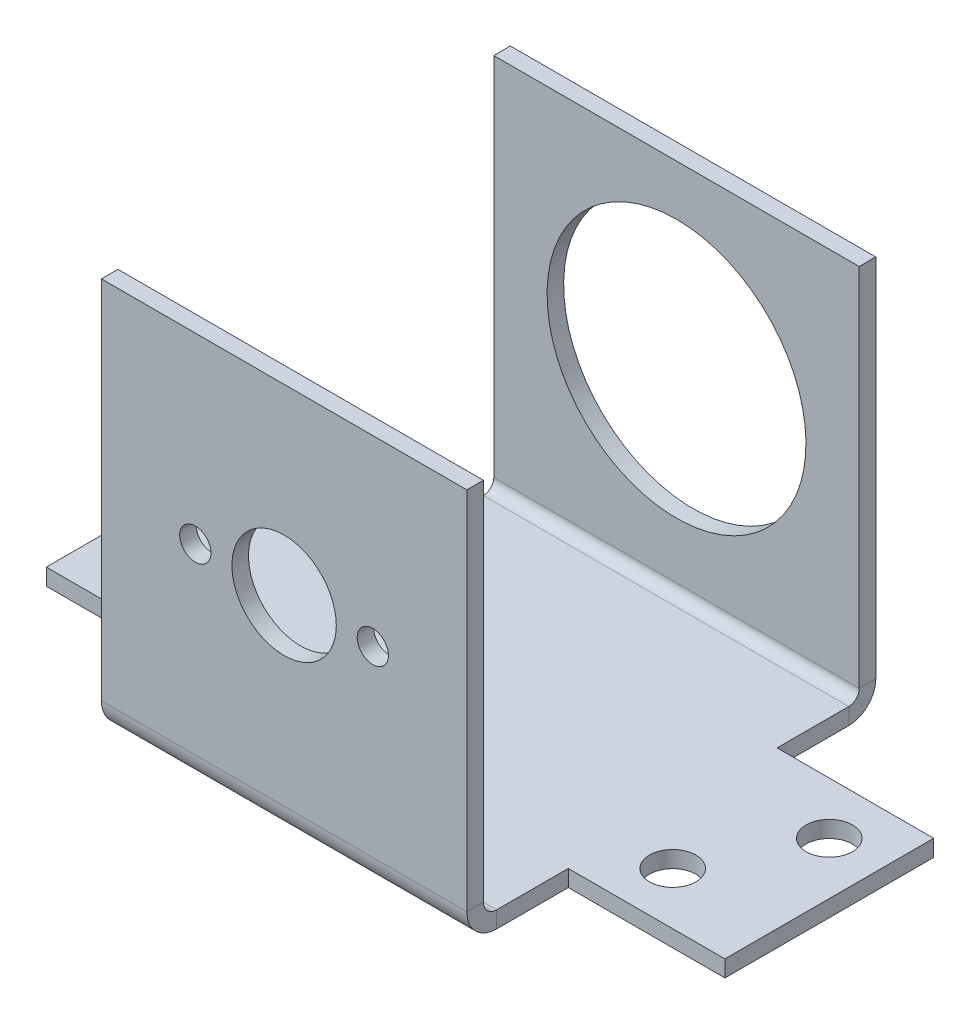
ISO-10303-21;
HEADER;
FILE_DESCRIPTION(('STEP AP214'),'2;1');
FILE_NAME('part.step','',(''),(''),'','','');
FILE_SCHEMA(('AUTOMOTIVE_DESIGN { 1 0 10303 214 1 1 1 1 }'));
ENDSEC;
DATA;
#1=APPLICATION_CONTEXT('core data for automotive mechanical design processes');
#2=APPLICATION_PROTOCOL_DEFINITION('international standard','automotive_design',2000,#1);
#3=PRODUCT_CONTEXT('',#1,'mechanical');
#4=PRODUCT('Part','Part','',(#3));
#5=PRODUCT_RELATED_PRODUCT_CATEGORY('part','',(#4));
#6=PRODUCT_DEFINITION_FORMATION('','',#4);
#7=PRODUCT_DEFINITION_CONTEXT('part definition',#1,'design');
#8=PRODUCT_DEFINITION('design','',#6,#7);
#9=PRODUCT_DEFINITION_SHAPE('','',#8);
#10=(LENGTH_UNIT() NAMED_UNIT(*) SI_UNIT(.MILLI.,.METRE.));
#11=(NAMED_UNIT(*) PLANE_ANGLE_UNIT() SI_UNIT($,.RADIAN.));
#12=(NAMED_UNIT(*) SI_UNIT($,.STERADIAN.) SOLID_ANGLE_UNIT());
#13=UNCERTAINTY_MEASURE_WITH_UNIT(LENGTH_MEASURE(1.E-05),#10,'distance_accuracy_value','');
#14=(GEOMETRIC_REPRESENTATION_CONTEXT(3) GLOBAL_UNCERTAINTY_ASSIGNED_CONTEXT((#13)) GLOBAL_UNIT_ASSIGNED_CONTEXT((#10,
#11,#12)) REPRESENTATION_CONTEXT('',''));
#15=CARTESIAN_POINT('',(0.,0.,0.));
#16=DIRECTION('',(0.,0.,1.));
#17=DIRECTION('',(1.,0.,0.));
#18=AXIS2_PLACEMENT_3D('',#15,#16,#17);
#19=CARTESIAN_POINT('',(-17.5,-20.3575000000001,-35.79375));
#20=DIRECTION('',(1.,0.,0.));
#21=DIRECTION('',(0.,0.,-1.));
#22=AXIS2_PLACEMENT_3D('',#19,#20,#21);
#23=PLANE('',#22);
#24=DIRECTION('',(0.,0.,1.));
#25=VECTOR('',#24,1.);
#26=CARTESIAN_POINT('',(-17.5,-18.7700000000001,-35.79375));
#27=LINE('',#26,#25);
#28=CARTESIAN_POINT('',(-17.5,-18.77,-2.06375));
#29=VERTEX_POINT('',#28);
#30=CARTESIAN_POINT('',(-17.5,-18.77,-8.92874999999999));
#31=VERTEX_POINT('',#30);
#32=EDGE_CURVE('E406',#29,#31,#27,.F.);
#33=ORIENTED_EDGE('',*,*,#32,.T.);
#34=DIRECTION('',(0.,1.,0.));
#35=VECTOR('',#34,1.);
#36=CARTESIAN_POINT('',(-17.5,-20.3575,-8.92874999999999));
#37=LINE('',#36,#35);
#38=CARTESIAN_POINT('',(-17.5,-20.3575,-8.92874999999999));
#39=VERTEX_POINT('',#38);
#40=EDGE_CURVE('E112',#39,#31,#37,.T.);
#41=ORIENTED_EDGE('',*,*,#40,.F.);
#42=DIRECTION('',(0.,0.,-1.));
#43=VECTOR('',#42,1.);
#44=CARTESIAN_POINT('',(-17.5,-20.3575,0.));
#45=LINE('',#44,#43);
#46=CARTESIAN_POINT('',(-17.5,-20.3575,-2.06374999999999));
#47=VERTEX_POINT('',#46);
#48=EDGE_CURVE('E396',#47,#39,#45,.T.);
#49=ORIENTED_EDGE('',*,*,#48,.F.);
#50=DIRECTION('',(0.,1.,0.));
#51=VECTOR('',#50,1.);
#52=CARTESIAN_POINT('',(-17.5,-18.77,-2.06375));
#53=LINE('',#52,#51);
#54=EDGE_CURVE('E414',#29,#47,#53,.F.);
#55=ORIENTED_EDGE('',*,*,#54,.F.);
#56=EDGE_LOOP('',(#33,#41,#49,#55));
#57=FACE_BOUND('',#56,.T.);
#58=ADVANCED_FACE('F86',(#57),#23,.F.);
#59=CARTESIAN_POINT('',(17.5,-20.3575,-0.793749999999994));
#60=DIRECTION('',(-1.,0.,0.));
#61=DIRECTION('',(0.,0.,1.));
#62=AXIS2_PLACEMENT_3D('',#59,#60,#61);
#63=PLANE('',#62);
#64=DIRECTION('',(0.,0.,-1.));
#65=VECTOR('',#64,1.);
#66=CARTESIAN_POINT('',(17.5,-18.77,-0.79375));
#67=LINE('',#66,#65);
#68=CARTESIAN_POINT('',(17.5,-18.7700000000001,-35.79375));
#69=VERTEX_POINT('',#68);
#70=CARTESIAN_POINT('',(17.5,-18.7700000000001,-28.92875));
#71=VERTEX_POINT('',#70);
#72=EDGE_CURVE('E399',#69,#71,#67,.F.);
#73=ORIENTED_EDGE('',*,*,#72,.T.);
#74=DIRECTION('',(0.,1.,0.));
#75=VECTOR('',#74,1.);
#76=CARTESIAN_POINT('',(17.5,-20.3575000000001,-28.92875));
#77=LINE('',#76,#75);
#78=CARTESIAN_POINT('',(17.5,-20.3575000000001,-28.92875));
#79=VERTEX_POINT('',#78);
#80=EDGE_CURVE('E301',#79,#71,#77,.T.);
#81=ORIENTED_EDGE('',*,*,#80,.F.);
#82=DIRECTION('',(0.,0.,1.));
#83=VECTOR('',#82,1.);
#84=CARTESIAN_POINT('',(17.5,-20.3575,0.));
#85=LINE('',#84,#83);
#86=CARTESIAN_POINT('',(17.5,-20.3575000000001,-35.79375));
#87=VERTEX_POINT('',#86);
#88=EDGE_CURVE('E387',#87,#79,#85,.T.);
#89=ORIENTED_EDGE('',*,*,#88,.F.);
#90=DIRECTION('',(0.,1.,0.));
#91=VECTOR('',#90,1.);
#92=CARTESIAN_POINT('',(17.5,-20.3575000000001,-35.79375));
#93=LINE('',#92,#91);
#94=EDGE_CURVE('E383',#87,#69,#93,.T.);
#95=ORIENTED_EDGE('',*,*,#94,.T.);
#96=EDGE_LOOP('',(#73,#81,#89,#95));
#97=FACE_BOUND('',#96,.T.);
#98=ADVANCED_FACE('F531',(#97),#63,.F.);
#99=CARTESIAN_POINT('',(17.5,17.5,0.79375));
#100=DIRECTION('',(1.,0.,0.));
#101=DIRECTION('',(0.,1.,0.));
#102=AXIS2_PLACEMENT_3D('',#99,#100,#101);
#103=PLANE('',#102);
#104=DIRECTION('',(0.,0.,1.));
#105=VECTOR('',#104,1.);
#106=CARTESIAN_POINT('',(17.5,-17.5,0.79375));
#107=LINE('',#106,#105);
#108=CARTESIAN_POINT('',(17.5,-17.5,-0.79375));
#109=VERTEX_POINT('',#108);
#110=CARTESIAN_POINT('',(17.5,-17.5,0.79375));
#111=VERTEX_POINT('',#110);
#112=EDGE_CURVE('E13',#109,#111,#107,.T.);
#113=ORIENTED_EDGE('',*,*,#112,.F.);
#114=DIRECTION('',(0.,1.,0.));
#115=VECTOR('',#114,1.);
#116=CARTESIAN_POINT('',(17.5,0.,-0.79375));
#117=LINE('',#116,#115);
#118=CARTESIAN_POINT('',(17.5,17.5,-0.79375));
#119=VERTEX_POINT('',#118);
#120=EDGE_CURVE('E483',#109,#119,#117,.T.);
#121=ORIENTED_EDGE('',*,*,#120,.T.);
#122=DIRECTION('',(0.,0.,1.));
#123=VECTOR('',#122,1.);
#124=CARTESIAN_POINT('',(17.5,17.5,0.79375));
#125=LINE('',#124,#123);
#126=CARTESIAN_POINT('',(17.5,17.5,0.79375));
#127=VERTEX_POINT('',#126);
#128=EDGE_CURVE('E96',#119,#127,#125,.T.);
#129=ORIENTED_EDGE('',*,*,#128,.T.);
#130=DIRECTION('',(0.,1.,0.));
#131=VECTOR('',#130,1.);
#132=CARTESIAN_POINT('',(17.5,17.5,0.79375));
#133=LINE('',#132,#131);
#134=EDGE_CURVE('E453',#111,#127,#133,.T.);
#135=ORIENTED_EDGE('',*,*,#134,.F.);
#136=EDGE_LOOP('',(#113,#121,#129,#135));
#137=FACE_BOUND('',#136,.T.);
#138=ADVANCED_FACE('F529',(#137),#103,.T.);
#139=CARTESIAN_POINT('',(-17.5,17.5,0.79375));
#140=DIRECTION('',(0.,1.,0.));
#141=DIRECTION('',(-1.,0.,0.));
#142=AXIS2_PLACEMENT_3D('',#139,#140,#141);
#143=PLANE('',#142);
#144=ORIENTED_EDGE('',*,*,#128,.F.);
#145=DIRECTION('',(1.,0.,0.));
#146=VECTOR('',#145,1.);
#147=CARTESIAN_POINT('',(0.,17.5,-0.79375));
#148=LINE('',#147,#146);
#149=CARTESIAN_POINT('',(-17.5,17.5,-0.79375));
#150=VERTEX_POINT('',#149);
#151=EDGE_CURVE('E478',#119,#150,#148,.F.);
#152=ORIENTED_EDGE('',*,*,#151,.T.);
#153=DIRECTION('',(0.,0.,1.));
#154=VECTOR('',#153,1.);
#155=CARTESIAN_POINT('',(-17.5,17.5,0.79375));
#156=LINE('',#155,#154);
#157=CARTESIAN_POINT('',(-17.5,17.5,0.79375));
#158=VERTEX_POINT('',#157);
#159=EDGE_CURVE('E495',#150,#158,#156,.T.);
#160=ORIENTED_EDGE('',*,*,#159,.T.);
#161=DIRECTION('',(-1.,0.,0.));
#162=VECTOR('',#161,1.);
#163=CARTESIAN_POINT('',(-17.5,17.5,0.79375));
#164=LINE('',#163,#162);
#165=EDGE_CURVE('E457',#127,#158,#164,.T.);
#166=ORIENTED_EDGE('',*,*,#165,.F.);
#167=EDGE_LOOP('',(#144,#152,#160,#166));
#168=FACE_BOUND('',#167,.T.);
#169=ADVANCED_FACE('F513',(#168),#143,.T.);
#170=CARTESIAN_POINT('',(-17.5,17.5,0.79375));
#171=DIRECTION('',(-1.,0.,0.));
#172=DIRECTION('',(0.,-1.,0.));
#173=AXIS2_PLACEMENT_3D('',#170,#171,#172);
#174=PLANE('',#173);
#175=ORIENTED_EDGE('',*,*,#159,.F.);
#176=DIRECTION('',(0.,1.,0.));
#177=VECTOR('',#176,1.);
#178=CARTESIAN_POINT('',(-17.5,0.,-0.79375));
#179=LINE('',#178,#177);
#180=CARTESIAN_POINT('',(-17.5,-17.5,-0.79375));
#181=VERTEX_POINT('',#180);
#182=EDGE_CURVE('E473',#150,#181,#179,.F.);
#183=ORIENTED_EDGE('',*,*,#182,.T.);
#184=DIRECTION('',(0.,0.,1.));
#185=VECTOR('',#184,1.);
#186=CARTESIAN_POINT('',(-17.5,-17.5,0.79375));
#187=LINE('',#186,#185);
#188=CARTESIAN_POINT('',(-17.5,-17.5,0.79375));
#189=VERTEX_POINT('',#188);
#190=EDGE_CURVE('E469',#181,#189,#187,.T.);
#191=ORIENTED_EDGE('',*,*,#190,.T.);
#192=DIRECTION('',(0.,-1.,0.));
#193=VECTOR('',#192,1.);
#194=CARTESIAN_POINT('',(-17.5,17.5,0.79375));
#195=LINE('',#194,#193);
#196=EDGE_CURVE('E444',#158,#189,#195,.T.);
#197=ORIENTED_EDGE('',*,*,#196,.F.);
#198=EDGE_LOOP('',(#175,#183,#191,#197));
#199=FACE_BOUND('',#198,.T.);
#200=ADVANCED_FACE('F503',(#199),#174,.T.);
#201=CARTESIAN_POINT('',(8.5,0.,0.79375));
#202=DIRECTION('',(0.,0.,1.));
#203=DIRECTION('',(1.,0.,0.));
#204=AXIS2_PLACEMENT_3D('',#201,#202,#203);
#205=CYLINDRICAL_SURFACE('',#204,1.5);
#206=CARTESIAN_POINT('',(8.5,0.,0.79375));
#207=DIRECTION('',(0.,0.,1.));
#208=DIRECTION('',(1.,0.,0.));
#209=AXIS2_PLACEMENT_3D('',#206,#207,#208);
#210=CIRCLE('',#209,1.5);
#211=CARTESIAN_POINT('',(10.,0.,0.79375));
#212=VERTEX_POINT('',#211);
#213=EDGE_CURVE('E440',#212,#212,#210,.T.);
#214=ORIENTED_EDGE('',*,*,#213,.T.);
#215=EDGE_LOOP('',(#214));
#216=FACE_BOUND('',#215,.T.);
#217=CARTESIAN_POINT('',(8.5,0.,-0.79375));
#218=DIRECTION('',(0.,0.,1.));
#219=DIRECTION('',(1.,0.,0.));
#220=AXIS2_PLACEMENT_3D('',#217,#218,#219);
#221=CIRCLE('',#220,1.5);
#222=CARTESIAN_POINT('',(10.,0.,-0.79375));
#223=VERTEX_POINT('',#222);
#224=EDGE_CURVE('E428',#223,#223,#221,.T.);
#225=ORIENTED_EDGE('',*,*,#224,.F.);
#226=EDGE_LOOP('',(#225));
#227=FACE_BOUND('',#226,.T.);
#228=ADVANCED_FACE('F571',(#216,#227),#205,.F.);
#229=CARTESIAN_POINT('',(-8.5,0.,0.79375));
#230=DIRECTION('',(0.,0.,1.));
#231=DIRECTION('',(1.,0.,0.));
#232=AXIS2_PLACEMENT_3D('',#229,#230,#231);
#233=CYLINDRICAL_SURFACE('',#232,1.5);
#234=CARTESIAN_POINT('',(-8.5,0.,0.79375));
#235=DIRECTION('',(0.,0.,1.));
#236=DIRECTION('',(1.,0.,0.));
#237=AXIS2_PLACEMENT_3D('',#234,#235,#236);
#238=CIRCLE('',#237,1.5);
#239=CARTESIAN_POINT('',(-7.,0.,0.79375));
#240=VERTEX_POINT('',#239);
#241=EDGE_CURVE('E461',#240,#240,#238,.T.);
#242=ORIENTED_EDGE('',*,*,#241,.T.);
#243=EDGE_LOOP('',(#242));
#244=FACE_BOUND('',#243,.T.);
#245=CARTESIAN_POINT('',(-8.5,0.,-0.79375));
#246=DIRECTION('',(0.,0.,1.));
#247=DIRECTION('',(1.,0.,0.));
#248=AXIS2_PLACEMENT_3D('',#245,#246,#247);
#249=CIRCLE('',#248,1.5);
#250=CARTESIAN_POINT('',(-7.,0.,-0.79375));
#251=VERTEX_POINT('',#250);
#252=EDGE_CURVE('E482',#251,#251,#249,.T.);
#253=ORIENTED_EDGE('',*,*,#252,.F.);
#254=EDGE_LOOP('',(#253));
#255=FACE_BOUND('',#254,.T.);
#256=ADVANCED_FACE('F574',(#244,#255),#233,.F.);
#257=CARTESIAN_POINT('',(0.,0.,0.79375));
#258=DIRECTION('',(0.,0.,1.));
#259=DIRECTION('',(1.,0.,0.));
#260=AXIS2_PLACEMENT_3D('',#257,#258,#259);
#261=CYLINDRICAL_SURFACE('',#260,5.);
#262=CARTESIAN_POINT('',(0.,0.,0.79375));
#263=DIRECTION('',(0.,0.,1.));
#264=DIRECTION('',(1.,0.,0.));
#265=AXIS2_PLACEMENT_3D('',#262,#263,#264);
#266=CIRCLE('',#265,5.);
#267=CARTESIAN_POINT('',(5.,0.,0.79375));
#268=VERTEX_POINT('',#267);
#269=EDGE_CURVE('E465',#268,#268,#266,.T.);
#270=ORIENTED_EDGE('',*,*,#269,.T.);
#271=EDGE_LOOP('',(#270));
#272=FACE_BOUND('',#271,.T.);
#273=CARTESIAN_POINT('',(0.,0.,-0.79375));
#274=DIRECTION('',(0.,0.,1.));
#275=DIRECTION('',(1.,0.,0.));
#276=AXIS2_PLACEMENT_3D('',#273,#274,#275);
#277=CIRCLE('',#276,5.);
#278=CARTESIAN_POINT('',(5.,0.,-0.79375));
#279=VERTEX_POINT('',#278);
#280=EDGE_CURVE('E445',#279,#279,#277,.T.);
#281=ORIENTED_EDGE('',*,*,#280,.F.);
#282=EDGE_LOOP('',(#281));
#283=FACE_BOUND('',#282,.T.);
#284=ADVANCED_FACE('F88',(#272,#283),#261,.F.);
#285=CARTESIAN_POINT('',(0.,0.,0.79375));
#286=DIRECTION('',(0.,0.,1.));
#287=DIRECTION('',(1.,0.,0.));
#288=AXIS2_PLACEMENT_3D('',#285,#286,#287);
#289=PLANE('',#288);
#290=ORIENTED_EDGE('',*,*,#213,.F.);
#291=EDGE_LOOP('',(#290));
#292=FACE_BOUND('',#291,.T.);
#293=ORIENTED_EDGE('',*,*,#196,.T.);
#294=DIRECTION('',(1.,0.,0.));
#295=VECTOR('',#294,1.);
#296=CARTESIAN_POINT('',(-17.5,-17.5,0.79375));
#297=LINE('',#296,#295);
#298=EDGE_CURVE('E449',#189,#111,#297,.T.);
#299=ORIENTED_EDGE('',*,*,#298,.T.);
#300=ORIENTED_EDGE('',*,*,#134,.T.);
#301=ORIENTED_EDGE('',*,*,#165,.T.);
#302=EDGE_LOOP('',(#293,#299,#300,#301));
#303=FACE_BOUND('',#302,.T.);
#304=ORIENTED_EDGE('',*,*,#241,.F.);
#305=EDGE_LOOP('',(#304));
#306=FACE_BOUND('',#305,.T.);
#307=ORIENTED_EDGE('',*,*,#269,.F.);
#308=EDGE_LOOP('',(#307));
#309=FACE_BOUND('',#308,.T.);
#310=ADVANCED_FACE('F508',(#292,#303,#306,#309),#289,.T.);
#311=CARTESIAN_POINT('',(0.,0.,-0.79375));
#312=DIRECTION('',(0.,0.,1.));
#313=DIRECTION('',(1.,0.,0.));
#314=AXIS2_PLACEMENT_3D('',#311,#312,#313);
#315=PLANE('',#314);
#316=ORIENTED_EDGE('',*,*,#224,.T.);
#317=EDGE_LOOP('',(#316));
#318=FACE_BOUND('',#317,.T.);
#319=ORIENTED_EDGE('',*,*,#182,.F.);
#320=ORIENTED_EDGE('',*,*,#151,.F.);
#321=ORIENTED_EDGE('',*,*,#120,.F.);
#322=DIRECTION('',(1.,0.,0.));
#323=VECTOR('',#322,1.);
#324=CARTESIAN_POINT('',(0.,-17.5,-0.79375));
#325=LINE('',#324,#323);
#326=EDGE_CURVE('E477',#181,#109,#325,.T.);
#327=ORIENTED_EDGE('',*,*,#326,.F.);
#328=EDGE_LOOP('',(#319,#320,#321,#327));
#329=FACE_BOUND('',#328,.T.);
#330=ORIENTED_EDGE('',*,*,#252,.T.);
#331=EDGE_LOOP('',(#330));
#332=FACE_BOUND('',#331,.T.);
#333=ORIENTED_EDGE('',*,*,#280,.T.);
#334=EDGE_LOOP('',(#333));
#335=FACE_BOUND('',#334,.T.);
#336=ADVANCED_FACE('F517',(#318,#329,#332,#335),#315,.F.);
#337=CARTESIAN_POINT('',(17.5,-17.5,-2.06375));
#338=DIRECTION('',(1.,0.,0.));
#339=DIRECTION('',(0.,0.,-1.));
#340=AXIS2_PLACEMENT_3D('',#337,#338,#339);
#341=PLANE('',#340);
#342=DIRECTION('',(0.,1.,0.));
#343=VECTOR('',#342,1.);
#344=CARTESIAN_POINT('',(17.5,-20.3575,-2.06374999999999));
#345=LINE('',#344,#343);
#346=CARTESIAN_POINT('',(17.5,-18.77,-2.06375));
#347=VERTEX_POINT('',#346);
#348=CARTESIAN_POINT('',(17.5,-20.3575,-2.06374999999999));
#349=VERTEX_POINT('',#348);
#350=EDGE_CURVE('E366',#347,#349,#345,.F.);
#351=ORIENTED_EDGE('',*,*,#350,.F.);
#352=CARTESIAN_POINT('',(17.5,-17.5,-2.06375));
#353=DIRECTION('',(-1.,0.,0.));
#354=DIRECTION('',(0.,0.,1.));
#355=AXIS2_PLACEMENT_3D('',#352,#353,#354);
#356=CIRCLE('',#355,1.27);
#357=EDGE_CURVE('E433',#109,#347,#356,.F.);
#358=ORIENTED_EDGE('',*,*,#357,.F.);
#359=ORIENTED_EDGE('',*,*,#112,.T.);
#360=CARTESIAN_POINT('',(17.5,-17.5,-2.06375));
#361=DIRECTION('',(-1.,0.,0.));
#362=DIRECTION('',(0.,0.,1.));
#363=AXIS2_PLACEMENT_3D('',#360,#361,#362);
#364=CIRCLE('',#363,2.8575);
#365=EDGE_CURVE('E424',#111,#349,#364,.F.);
#366=ORIENTED_EDGE('',*,*,#365,.T.);
#367=EDGE_LOOP('',(#351,#358,#359,#366));
#368=FACE_BOUND('',#367,.T.);
#369=ADVANCED_FACE('F527',(#368),#341,.T.);
#370=CARTESIAN_POINT('',(-17.5,-17.5,-2.06375));
#371=DIRECTION('',(1.,0.,0.));
#372=DIRECTION('',(0.,0.,-1.));
#373=AXIS2_PLACEMENT_3D('',#370,#371,#372);
#374=PLANE('',#373);
#375=CARTESIAN_POINT('',(-17.5,-17.5,-2.06375));
#376=DIRECTION('',(-1.,0.,0.));
#377=DIRECTION('',(0.,0.,1.));
#378=AXIS2_PLACEMENT_3D('',#375,#376,#377);
#379=CIRCLE('',#378,1.27);
#380=EDGE_CURVE('E382',#29,#181,#379,.T.);
#381=ORIENTED_EDGE('',*,*,#380,.F.);
#382=ORIENTED_EDGE('',*,*,#54,.T.);
#383=CARTESIAN_POINT('',(-17.5,-17.5,-2.06375));
#384=DIRECTION('',(-1.,0.,0.));
#385=DIRECTION('',(0.,0.,1.));
#386=AXIS2_PLACEMENT_3D('',#383,#384,#385);
#387=CIRCLE('',#386,2.8575);
#388=EDGE_CURVE('E429',#47,#189,#387,.T.);
#389=ORIENTED_EDGE('',*,*,#388,.T.);
#390=ORIENTED_EDGE('',*,*,#190,.F.);
#391=EDGE_LOOP('',(#381,#382,#389,#390));
#392=FACE_BOUND('',#391,.T.);
#393=ADVANCED_FACE('F558',(#392),#374,.F.);
#394=CARTESIAN_POINT('',(-17.5,-17.5,-2.06375));
#395=DIRECTION('',(-1.,0.,0.));
#396=DIRECTION('',(0.,-1.,0.));
#397=AXIS2_PLACEMENT_3D('',#394,#395,#396);
#398=CYLINDRICAL_SURFACE('',#397,2.8575);
#399=ORIENTED_EDGE('',*,*,#298,.F.);
#400=ORIENTED_EDGE('',*,*,#388,.F.);
#401=DIRECTION('',(-1.,0.,0.));
#402=VECTOR('',#401,1.);
#403=CARTESIAN_POINT('',(17.5,-20.3575,-2.06374999999999));
#404=LINE('',#403,#402);
#405=EDGE_CURVE('E410',#47,#349,#404,.F.);
#406=ORIENTED_EDGE('',*,*,#405,.T.);
#407=ORIENTED_EDGE('',*,*,#365,.F.);
#408=EDGE_LOOP('',(#399,#400,#406,#407));
#409=FACE_BOUND('',#408,.T.);
#410=ADVANCED_FACE('F553',(#409),#398,.T.);
#411=CARTESIAN_POINT('',(-17.5,-17.5,-2.06375));
#412=DIRECTION('',(-1.,0.,0.));
#413=DIRECTION('',(0.,-1.,0.));
#414=AXIS2_PLACEMENT_3D('',#411,#412,#413);
#415=CYLINDRICAL_SURFACE('',#414,1.27);
#416=ORIENTED_EDGE('',*,*,#326,.T.);
#417=ORIENTED_EDGE('',*,*,#357,.T.);
#418=DIRECTION('',(-1.,0.,0.));
#419=VECTOR('',#418,1.);
#420=CARTESIAN_POINT('',(17.5,-18.77,-2.06375));
#421=LINE('',#420,#419);
#422=EDGE_CURVE('E418',#347,#29,#421,.T.);
#423=ORIENTED_EDGE('',*,*,#422,.T.);
#424=ORIENTED_EDGE('',*,*,#380,.T.);
#425=EDGE_LOOP('',(#416,#417,#423,#424));
#426=FACE_BOUND('',#425,.T.);
#427=ADVANCED_FACE('F522',(#426),#415,.F.);
#428=CARTESIAN_POINT('',(-17.5,-20.3575000000001,-28.92875));
#429=VERTEX_POINT('',#428);
#430=CARTESIAN_POINT('',(-17.5,-20.3575000000001,-35.79375));
#431=VERTEX_POINT('',#430);
#432=EDGE_CURVE('E104',#429,#431,#45,.T.);
#433=ORIENTED_EDGE('',*,*,#432,.F.);
#434=DIRECTION('',(0.,1.,0.));
#435=VECTOR('',#434,1.);
#436=CARTESIAN_POINT('',(-17.5,-20.3575000000001,-28.92875));
#437=LINE('',#436,#435);
#438=CARTESIAN_POINT('',(-17.5,-18.7700000000001,-28.92875));
#439=VERTEX_POINT('',#438);
#440=EDGE_CURVE('E241',#429,#439,#437,.T.);
#441=ORIENTED_EDGE('',*,*,#440,.T.);
#442=CARTESIAN_POINT('',(-17.5,-18.7700000000001,-35.79375));
#443=VERTEX_POINT('',#442);
#444=EDGE_CURVE('E409',#439,#443,#27,.F.);
#445=ORIENTED_EDGE('',*,*,#444,.T.);
#446=DIRECTION('',(0.,1.,0.));
#447=VECTOR('',#446,1.);
#448=CARTESIAN_POINT('',(-17.5,-20.3575000000001,-35.79375));
#449=LINE('',#448,#447);
#450=EDGE_CURVE('E378',#431,#443,#449,.T.);
#451=ORIENTED_EDGE('',*,*,#450,.F.);
#452=EDGE_LOOP('',(#433,#441,#445,#451));
#453=FACE_BOUND('',#452,.T.);
#454=ADVANCED_FACE('F543',(#453),#23,.F.);
#455=CARTESIAN_POINT('',(17.5,-20.3575,-8.92875));
#456=VERTEX_POINT('',#455);
#457=EDGE_CURVE('E391',#456,#349,#85,.T.);
#458=ORIENTED_EDGE('',*,*,#457,.F.);
#459=DIRECTION('',(0.,1.,0.));
#460=VECTOR('',#459,1.);
#461=CARTESIAN_POINT('',(17.5,-20.3575,-8.92875));
#462=LINE('',#461,#460);
#463=CARTESIAN_POINT('',(17.5,-18.77,-8.92875));
#464=VERTEX_POINT('',#463);
#465=EDGE_CURVE('E290',#456,#464,#462,.T.);
#466=ORIENTED_EDGE('',*,*,#465,.T.);
#467=EDGE_CURVE('E402',#464,#347,#67,.F.);
#468=ORIENTED_EDGE('',*,*,#467,.T.);
#469=ORIENTED_EDGE('',*,*,#350,.T.);
#470=EDGE_LOOP('',(#458,#466,#468,#469));
#471=FACE_BOUND('',#470,.T.);
#472=ADVANCED_FACE('F540',(#471),#63,.F.);
#473=CARTESIAN_POINT('',(0.,-20.3575,0.));
#474=DIRECTION('',(0.,1.,0.));
#475=DIRECTION('',(0.,0.,1.));
#476=AXIS2_PLACEMENT_3D('',#473,#474,#475);
#477=PLANE('',#476);
#478=CARTESIAN_POINT('',(-22.5,-20.3575,-13.92875));
#479=DIRECTION('',(0.,1.,0.));
#480=DIRECTION('',(0.,0.,1.));
#481=AXIS2_PLACEMENT_3D('',#478,#479,#480);
#482=CIRCLE('',#481,2.2225);
#483=CARTESIAN_POINT('',(-22.5,-20.3575,-11.70625));
#484=VERTEX_POINT('',#483);
#485=EDGE_CURVE('E1072',#484,#484,#482,.F.);
#486=ORIENTED_EDGE('',*,*,#485,.F.);
#487=EDGE_LOOP('',(#486));
#488=FACE_BOUND('',#487,.T.);
#489=CARTESIAN_POINT('',(-27.5,-20.3575000000001,-23.92875));
#490=DIRECTION('',(0.,1.,0.));
#491=DIRECTION('',(0.,0.,1.));
#492=AXIS2_PLACEMENT_3D('',#489,#490,#491);
#493=CIRCLE('',#492,2.2225);
#494=CARTESIAN_POINT('',(-27.5,-20.3575000000001,-21.70625));
#495=VERTEX_POINT('',#494);
#496=EDGE_CURVE('E1075',#495,#495,#493,.F.);
#497=ORIENTED_EDGE('',*,*,#496,.F.);
#498=EDGE_LOOP('',(#497));
#499=FACE_BOUND('',#498,.T.);
#500=CARTESIAN_POINT('',(22.5,-20.3575,-13.92875));
#501=DIRECTION('',(0.,1.,0.));
#502=DIRECTION('',(0.,0.,1.));
#503=AXIS2_PLACEMENT_3D('',#500,#501,#502);
#504=CIRCLE('',#503,2.2225);
#505=CARTESIAN_POINT('',(22.5,-20.3575,-11.70625));
#506=VERTEX_POINT('',#505);
#507=EDGE_CURVE('E260',#506,#506,#504,.T.);
#508=ORIENTED_EDGE('',*,*,#507,.T.);
#509=EDGE_LOOP('',(#508));
#510=FACE_BOUND('',#509,.T.);
#511=CARTESIAN_POINT('',(27.5,-20.3575000000001,-23.92875));
#512=DIRECTION('',(0.,1.,0.));
#513=DIRECTION('',(0.,0.,1.));
#514=AXIS2_PLACEMENT_3D('',#511,#512,#513);
#515=CIRCLE('',#514,2.2225);
#516=CARTESIAN_POINT('',(27.5,-20.3575000000001,-21.70625));
#517=VERTEX_POINT('',#516);
#518=EDGE_CURVE('E1088',#517,#517,#515,.T.);
#519=ORIENTED_EDGE('',*,*,#518,.T.);
#520=EDGE_LOOP('',(#519));
#521=FACE_BOUND('',#520,.T.);
#522=ORIENTED_EDGE('',*,*,#405,.F.);
#523=ORIENTED_EDGE('',*,*,#48,.T.);
#524=DIRECTION('',(1.,0.,0.));
#525=VECTOR('',#524,1.);
#526=CARTESIAN_POINT('',(-17.5,-20.3575,-8.92874999999999));
#527=LINE('',#526,#525);
#528=CARTESIAN_POINT('',(-32.5,-20.3575,-8.92874999999999));
#529=VERTEX_POINT('',#528);
#530=EDGE_CURVE('E249',#529,#39,#527,.T.);
#531=ORIENTED_EDGE('',*,*,#530,.F.);
#532=DIRECTION('',(0.,0.,1.));
#533=VECTOR('',#532,1.);
#534=CARTESIAN_POINT('',(-32.5,-20.3575,-8.92874999999999));
#535=LINE('',#534,#533);
#536=CARTESIAN_POINT('',(-32.5,-20.3575000000001,-28.92875));
#537=VERTEX_POINT('',#536);
#538=EDGE_CURVE('E231',#537,#529,#535,.T.);
#539=ORIENTED_EDGE('',*,*,#538,.F.);
#540=DIRECTION('',(-1.,0.,0.));
#541=VECTOR('',#540,1.);
#542=CARTESIAN_POINT('',(-17.5,-20.3575000000001,-28.92875));
#543=LINE('',#542,#541);
#544=EDGE_CURVE('E247',#429,#537,#543,.T.);
#545=ORIENTED_EDGE('',*,*,#544,.F.);
#546=ORIENTED_EDGE('',*,*,#432,.T.);
#547=DIRECTION('',(1.,0.,0.));
#548=VECTOR('',#547,1.);
#549=CARTESIAN_POINT('',(0.,-20.3575000000001,-35.79375));
#550=LINE('',#549,#548);
#551=EDGE_CURVE('E392',#431,#87,#550,.T.);
#552=ORIENTED_EDGE('',*,*,#551,.T.);
#553=ORIENTED_EDGE('',*,*,#88,.T.);
#554=DIRECTION('',(-1.,0.,0.));
#555=VECTOR('',#554,1.);
#556=CARTESIAN_POINT('',(17.5,-20.3575000000001,-28.92875));
#557=LINE('',#556,#555);
#558=CARTESIAN_POINT('',(32.5,-20.3575000000001,-28.92875));
#559=VERTEX_POINT('',#558);
#560=EDGE_CURVE('E286',#559,#79,#557,.T.);
#561=ORIENTED_EDGE('',*,*,#560,.F.);
#562=DIRECTION('',(0.,0.,-1.));
#563=VECTOR('',#562,1.);
#564=CARTESIAN_POINT('',(32.5,-20.3575,-8.92875));
#565=LINE('',#564,#563);
#566=CARTESIAN_POINT('',(32.5,-20.3575,-8.92875));
#567=VERTEX_POINT('',#566);
#568=EDGE_CURVE('E281',#567,#559,#565,.T.);
#569=ORIENTED_EDGE('',*,*,#568,.F.);
#570=DIRECTION('',(1.,0.,0.));
#571=VECTOR('',#570,1.);
#572=CARTESIAN_POINT('',(17.5,-20.3575,-8.92875));
#573=LINE('',#572,#571);
#574=EDGE_CURVE('E277',#456,#567,#573,.T.);
#575=ORIENTED_EDGE('',*,*,#574,.F.);
#576=ORIENTED_EDGE('',*,*,#457,.T.);
#577=EDGE_LOOP('',(#522,#523,#531,#539,#545,#546,#552,#553,#561,#569,#575,#576));
#578=FACE_BOUND('',#577,.T.);
#579=ADVANCED_FACE('F246',(#488,#499,#510,#521,#578),#477,.F.);
#580=CARTESIAN_POINT('',(0.,-18.77,0.));
#581=DIRECTION('',(0.,1.,0.));
#582=DIRECTION('',(0.,0.,1.));
#583=AXIS2_PLACEMENT_3D('',#580,#581,#582);
#584=PLANE('',#583);
#585=CARTESIAN_POINT('',(-22.5,-18.77,-13.92875));
#586=DIRECTION('',(0.,-1.,0.));
#587=DIRECTION('',(0.,0.,1.));
#588=AXIS2_PLACEMENT_3D('',#585,#586,#587);
#589=CIRCLE('',#588,2.2225);
#590=CARTESIAN_POINT('',(-22.5,-18.77,-11.70625));
#591=VERTEX_POINT('',#590);
#592=EDGE_CURVE('E1069',#591,#591,#589,.T.);
#593=ORIENTED_EDGE('',*,*,#592,.T.);
#594=EDGE_LOOP('',(#593));
#595=FACE_BOUND('',#594,.T.);
#596=CARTESIAN_POINT('',(-27.5,-18.7700000000001,-23.92875));
#597=DIRECTION('',(0.,-1.,0.));
#598=DIRECTION('',(0.,0.,1.));
#599=AXIS2_PLACEMENT_3D('',#596,#597,#598);
#600=CIRCLE('',#599,2.2225);
#601=CARTESIAN_POINT('',(-27.5,-18.7700000000001,-21.70625));
#602=VERTEX_POINT('',#601);
#603=EDGE_CURVE('E1141',#602,#602,#600,.T.);
#604=ORIENTED_EDGE('',*,*,#603,.T.);
#605=EDGE_LOOP('',(#604));
#606=FACE_BOUND('',#605,.T.);
#607=CARTESIAN_POINT('',(22.5,-18.77,-13.92875));
#608=DIRECTION('',(0.,1.,0.));
#609=DIRECTION('',(0.,0.,1.));
#610=AXIS2_PLACEMENT_3D('',#607,#608,#609);
#611=CIRCLE('',#610,2.2225);
#612=CARTESIAN_POINT('',(22.5,-18.77,-11.70625));
#613=VERTEX_POINT('',#612);
#614=EDGE_CURVE('E1080',#613,#613,#611,.T.);
#615=ORIENTED_EDGE('',*,*,#614,.F.);
#616=EDGE_LOOP('',(#615));
#617=FACE_BOUND('',#616,.T.);
#618=CARTESIAN_POINT('',(27.5,-18.7700000000001,-23.92875));
#619=DIRECTION('',(0.,1.,0.));
#620=DIRECTION('',(0.,0.,1.));
#621=AXIS2_PLACEMENT_3D('',#618,#619,#620);
#622=CIRCLE('',#621,2.2225);
#623=CARTESIAN_POINT('',(27.5,-18.7700000000001,-21.70625));
#624=VERTEX_POINT('',#623);
#625=EDGE_CURVE('E1074',#624,#624,#622,.T.);
#626=ORIENTED_EDGE('',*,*,#625,.F.);
#627=EDGE_LOOP('',(#626));
#628=FACE_BOUND('',#627,.T.);
#629=ORIENTED_EDGE('',*,*,#32,.F.);
#630=ORIENTED_EDGE('',*,*,#422,.F.);
#631=ORIENTED_EDGE('',*,*,#467,.F.);
#632=DIRECTION('',(1.,0.,0.));
#633=VECTOR('',#632,1.);
#634=CARTESIAN_POINT('',(17.5,-18.77,-8.92875));
#635=LINE('',#634,#633);
#636=CARTESIAN_POINT('',(32.5,-18.77,-8.92875000000001));
#637=VERTEX_POINT('',#636);
#638=EDGE_CURVE('E272',#464,#637,#635,.T.);
#639=ORIENTED_EDGE('',*,*,#638,.T.);
#640=DIRECTION('',(0.,0.,-1.));
#641=VECTOR('',#640,1.);
#642=CARTESIAN_POINT('',(32.5,-18.77,-8.92875000000001));
#643=LINE('',#642,#641);
#644=CARTESIAN_POINT('',(32.5,-18.7700000000001,-28.92875));
#645=VERTEX_POINT('',#644);
#646=EDGE_CURVE('E294',#637,#645,#643,.T.);
#647=ORIENTED_EDGE('',*,*,#646,.T.);
#648=DIRECTION('',(-1.,0.,0.));
#649=VECTOR('',#648,1.);
#650=CARTESIAN_POINT('',(17.5,-18.7700000000001,-28.92875));
#651=LINE('',#650,#649);
#652=EDGE_CURVE('E282',#645,#71,#651,.T.);
#653=ORIENTED_EDGE('',*,*,#652,.T.);
#654=ORIENTED_EDGE('',*,*,#72,.F.);
#655=DIRECTION('',(-1.,0.,0.));
#656=VECTOR('',#655,1.);
#657=CARTESIAN_POINT('',(17.5,-18.7700000000001,-35.79375));
#658=LINE('',#657,#656);
#659=EDGE_CURVE('E403',#443,#69,#658,.F.);
#660=ORIENTED_EDGE('',*,*,#659,.F.);
#661=ORIENTED_EDGE('',*,*,#444,.F.);
#662=DIRECTION('',(-1.,0.,0.));
#663=VECTOR('',#662,1.);
#664=CARTESIAN_POINT('',(-17.5,-18.7700000000001,-28.92875));
#665=LINE('',#664,#663);
#666=CARTESIAN_POINT('',(-32.5,-18.7700000000001,-28.92875));
#667=VERTEX_POINT('',#666);
#668=EDGE_CURVE('E265',#439,#667,#665,.T.);
#669=ORIENTED_EDGE('',*,*,#668,.T.);
#670=DIRECTION('',(0.,0.,1.));
#671=VECTOR('',#670,1.);
#672=CARTESIAN_POINT('',(-32.5,-18.77,-8.92874999999999));
#673=LINE('',#672,#671);
#674=CARTESIAN_POINT('',(-32.5,-18.77,-8.92874999999999));
#675=VERTEX_POINT('',#674);
#676=EDGE_CURVE('E234',#667,#675,#673,.T.);
#677=ORIENTED_EDGE('',*,*,#676,.T.);
#678=DIRECTION('',(1.,0.,0.));
#679=VECTOR('',#678,1.);
#680=CARTESIAN_POINT('',(-17.5,-18.77,-8.92875));
#681=LINE('',#680,#679);
#682=EDGE_CURVE('E254',#675,#31,#681,.T.);
#683=ORIENTED_EDGE('',*,*,#682,.T.);
#684=EDGE_LOOP('',(#629,#630,#631,#639,#647,#653,#654,#660,#661,#669,#677,#683));
#685=FACE_BOUND('',#684,.T.);
#686=ADVANCED_FACE('F635',(#595,#606,#617,#628,#685),#584,.T.);
#687=CARTESIAN_POINT('',(17.5,-17.7700000000001,-35.79375));
#688=DIRECTION('',(1.,0.,0.));
#689=DIRECTION('',(0.,0.,-1.));
#690=AXIS2_PLACEMENT_3D('',#687,#688,#689);
#691=PLANE('',#690);
#692=DIRECTION('',(0.,0.,1.));
#693=VECTOR('',#692,1.);
#694=CARTESIAN_POINT('',(17.5,-17.7700000000001,-38.3812500000005));
#695=LINE('',#694,#693);
#696=CARTESIAN_POINT('',(17.5,-17.7700000000001,-36.79375));
#697=VERTEX_POINT('',#696);
#698=CARTESIAN_POINT('',(17.5,-17.7700000000001,-38.38125));
#699=VERTEX_POINT('',#698);
#700=EDGE_CURVE('E358',#697,#699,#695,.F.);
#701=ORIENTED_EDGE('',*,*,#700,.F.);
#702=CARTESIAN_POINT('',(17.5,-17.7700000000001,-35.79375));
#703=DIRECTION('',(-1.,0.,0.));
#704=DIRECTION('',(0.,0.,1.));
#705=AXIS2_PLACEMENT_3D('',#702,#703,#704);
#706=CIRCLE('',#705,0.999999999999994);
#707=EDGE_CURVE('E371',#69,#697,#706,.F.);
#708=ORIENTED_EDGE('',*,*,#707,.F.);
#709=ORIENTED_EDGE('',*,*,#94,.F.);
#710=CARTESIAN_POINT('',(17.5,-17.7700000000001,-35.79375));
#711=DIRECTION('',(-1.,0.,0.));
#712=DIRECTION('',(0.,0.,1.));
#713=AXIS2_PLACEMENT_3D('',#710,#711,#712);
#714=CIRCLE('',#713,2.58749999999999);
#715=EDGE_CURVE('E362',#87,#699,#714,.F.);
#716=ORIENTED_EDGE('',*,*,#715,.T.);
#717=EDGE_LOOP('',(#701,#708,#709,#716));
#718=FACE_BOUND('',#717,.T.);
#719=ADVANCED_FACE('F629',(#718),#691,.T.);
#720=CARTESIAN_POINT('',(-17.5,-17.7700000000001,-35.79375));
#721=DIRECTION('',(1.,0.,0.));
#722=DIRECTION('',(0.,0.,-1.));
#723=AXIS2_PLACEMENT_3D('',#720,#721,#722);
#724=PLANE('',#723);
#725=CARTESIAN_POINT('',(-17.5,-17.7700000000001,-35.79375));
#726=DIRECTION('',(-1.,0.,0.));
#727=DIRECTION('',(0.,0.,1.));
#728=AXIS2_PLACEMENT_3D('',#725,#726,#727);
#729=CIRCLE('',#728,0.999999999999994);
#730=CARTESIAN_POINT('',(-17.5,-17.7700000000001,-36.79375));
#731=VERTEX_POINT('',#730);
#732=EDGE_CURVE('E322',#731,#443,#729,.T.);
#733=ORIENTED_EDGE('',*,*,#732,.F.);
#734=DIRECTION('',(0.,0.,1.));
#735=VECTOR('',#734,1.);
#736=CARTESIAN_POINT('',(-17.5,-17.7700000000001,-36.79375));
#737=LINE('',#736,#735);
#738=CARTESIAN_POINT('',(-17.5,-17.7700000000001,-38.38125));
#739=VERTEX_POINT('',#738);
#740=EDGE_CURVE('E351',#731,#739,#737,.F.);
#741=ORIENTED_EDGE('',*,*,#740,.T.);
#742=CARTESIAN_POINT('',(-17.5,-17.7700000000001,-35.79375));
#743=DIRECTION('',(-1.,0.,0.));
#744=DIRECTION('',(0.,0.,1.));
#745=AXIS2_PLACEMENT_3D('',#742,#743,#744);
#746=CIRCLE('',#745,2.58749999999999);
#747=EDGE_CURVE('E367',#739,#431,#746,.T.);
#748=ORIENTED_EDGE('',*,*,#747,.T.);
#749=ORIENTED_EDGE('',*,*,#450,.T.);
#750=EDGE_LOOP('',(#733,#741,#748,#749));
#751=FACE_BOUND('',#750,.T.);
#752=ADVANCED_FACE('F634',(#751),#724,.F.);
#753=CARTESIAN_POINT('',(-17.5,-17.7700000000001,-35.79375));
#754=DIRECTION('',(-1.,0.,0.));
#755=DIRECTION('',(0.,0.,-1.));
#756=AXIS2_PLACEMENT_3D('',#753,#754,#755);
#757=CYLINDRICAL_SURFACE('',#756,2.58749999999999);
#758=ORIENTED_EDGE('',*,*,#551,.F.);
#759=ORIENTED_EDGE('',*,*,#747,.F.);
#760=DIRECTION('',(-1.,0.,0.));
#761=VECTOR('',#760,1.);
#762=CARTESIAN_POINT('',(0.,-17.7700000000001,-38.38125));
#763=LINE('',#762,#761);
#764=EDGE_CURVE('E347',#699,#739,#763,.T.);
#765=ORIENTED_EDGE('',*,*,#764,.F.);
#766=ORIENTED_EDGE('',*,*,#715,.F.);
#767=EDGE_LOOP('',(#758,#759,#765,#766));
#768=FACE_BOUND('',#767,.T.);
#769=ADVANCED_FACE('F648',(#768),#757,.T.);
#770=CARTESIAN_POINT('',(-17.5,-17.7700000000001,-35.79375));
#771=DIRECTION('',(-1.,0.,0.));
#772=DIRECTION('',(0.,0.,-1.));
#773=AXIS2_PLACEMENT_3D('',#770,#771,#772);
#774=CYLINDRICAL_SURFACE('',#773,0.999999999999994);
#775=ORIENTED_EDGE('',*,*,#659,.T.);
#776=ORIENTED_EDGE('',*,*,#707,.T.);
#777=DIRECTION('',(1.,0.,0.));
#778=VECTOR('',#777,1.);
#779=CARTESIAN_POINT('',(17.5,-17.7700000000001,-36.79375));
#780=LINE('',#779,#778);
#781=EDGE_CURVE('E355',#697,#731,#780,.F.);
#782=ORIENTED_EDGE('',*,*,#781,.T.);
#783=ORIENTED_EDGE('',*,*,#732,.T.);
#784=EDGE_LOOP('',(#775,#776,#782,#783));
#785=FACE_BOUND('',#784,.T.);
#786=ADVANCED_FACE('F659',(#785),#774,.F.);
#787=CARTESIAN_POINT('',(-17.5,-18.7700000000001,-38.38125));
#788=DIRECTION('',(1.,0.,0.));
#789=DIRECTION('',(0.,0.,-1.));
#790=AXIS2_PLACEMENT_3D('',#787,#788,#789);
#791=PLANE('',#790);
#792=ORIENTED_EDGE('',*,*,#740,.F.);
#793=DIRECTION('',(0.,1.,0.));
#794=VECTOR('',#793,1.);
#795=CARTESIAN_POINT('',(-17.5,-18.7700000000001,-36.79375));
#796=LINE('',#795,#794);
#797=CARTESIAN_POINT('',(-17.5,17.2299999999999,-36.7937500000003));
#798=VERTEX_POINT('',#797);
#799=EDGE_CURVE('E344',#731,#798,#796,.T.);
#800=ORIENTED_EDGE('',*,*,#799,.T.);
#801=DIRECTION('',(0.,0.,1.));
#802=VECTOR('',#801,1.);
#803=CARTESIAN_POINT('',(-17.5,17.2299999999999,-38.3812500000003));
#804=LINE('',#803,#802);
#805=CARTESIAN_POINT('',(-17.5,17.2299999999999,-38.3812500000003));
#806=VERTEX_POINT('',#805);
#807=EDGE_CURVE('E318',#806,#798,#804,.T.);
#808=ORIENTED_EDGE('',*,*,#807,.F.);
#809=DIRECTION('',(0.,-1.,0.));
#810=VECTOR('',#809,1.);
#811=CARTESIAN_POINT('',(-17.5,-2.62888954286574E-13,-38.3812500000001));
#812=LINE('',#811,#810);
#813=EDGE_CURVE('E334',#739,#806,#812,.F.);
#814=ORIENTED_EDGE('',*,*,#813,.F.);
#815=EDGE_LOOP('',(#792,#800,#808,#814));
#816=FACE_BOUND('',#815,.T.);
#817=ADVANCED_FACE('F670',(#816),#791,.F.);
#818=CARTESIAN_POINT('',(17.5,17.2299999999999,-38.3812500000003));
#819=DIRECTION('',(-1.,0.,0.));
#820=DIRECTION('',(0.,-1.,0.));
#821=AXIS2_PLACEMENT_3D('',#818,#819,#820);
#822=PLANE('',#821);
#823=ORIENTED_EDGE('',*,*,#700,.T.);
#824=DIRECTION('',(0.,1.,0.));
#825=VECTOR('',#824,1.);
#826=CARTESIAN_POINT('',(17.5,-2.66262027712084E-13,-38.3812500000001));
#827=LINE('',#826,#825);
#828=CARTESIAN_POINT('',(17.5,17.2299999999999,-38.3812500000003));
#829=VERTEX_POINT('',#828);
#830=EDGE_CURVE('E327',#829,#699,#827,.F.);
#831=ORIENTED_EDGE('',*,*,#830,.F.);
#832=DIRECTION('',(0.,0.,1.));
#833=VECTOR('',#832,1.);
#834=CARTESIAN_POINT('',(17.5,17.2299999999999,-38.3812500000003));
#835=LINE('',#834,#833);
#836=CARTESIAN_POINT('',(17.5,17.2299999999999,-36.7937500000003));
#837=VERTEX_POINT('',#836);
#838=EDGE_CURVE('E323',#829,#837,#835,.T.);
#839=ORIENTED_EDGE('',*,*,#838,.T.);
#840=DIRECTION('',(0.,-1.,0.));
#841=VECTOR('',#840,1.);
#842=CARTESIAN_POINT('',(17.5,17.2299999999999,-36.7937500000003));
#843=LINE('',#842,#841);
#844=EDGE_CURVE('E337',#837,#697,#843,.T.);
#845=ORIENTED_EDGE('',*,*,#844,.T.);
#846=EDGE_LOOP('',(#823,#831,#839,#845));
#847=FACE_BOUND('',#846,.T.);
#848=ADVANCED_FACE('F681',(#847),#822,.F.);
#849=CARTESIAN_POINT('',(0.,-2.62888954286574E-13,-38.3812500000001));
#850=DIRECTION('',(0.,0.,-1.));
#851=DIRECTION('',(0.,1.,0.));
#852=AXIS2_PLACEMENT_3D('',#849,#850,#851);
#853=PLANE('',#852);
#854=CARTESIAN_POINT('',(0.,-2.6632342164934E-13,-38.3812500000001));
#855=DIRECTION('',(0.,0.,-1.));
#856=DIRECTION('',(0.,1.,0.));
#857=AXIS2_PLACEMENT_3D('',#854,#855,#856);
#858=CIRCLE('',#857,12.4);
#859=CARTESIAN_POINT('',(0.,12.3999999999997,-38.3812500000002));
#860=VERTEX_POINT('',#859);
#861=EDGE_CURVE('E305',#860,#860,#858,.T.);
#862=ORIENTED_EDGE('',*,*,#861,.F.);
#863=EDGE_LOOP('',(#862));
#864=FACE_BOUND('',#863,.T.);
#865=ORIENTED_EDGE('',*,*,#830,.T.);
#866=ORIENTED_EDGE('',*,*,#764,.T.);
#867=ORIENTED_EDGE('',*,*,#813,.T.);
#868=DIRECTION('',(-1.,0.,0.));
#869=VECTOR('',#868,1.);
#870=CARTESIAN_POINT('',(0.,17.2299999999999,-38.3812500000003));
#871=LINE('',#870,#869);
#872=EDGE_CURVE('E331',#806,#829,#871,.F.);
#873=ORIENTED_EDGE('',*,*,#872,.T.);
#874=EDGE_LOOP('',(#865,#866,#867,#873));
#875=FACE_BOUND('',#874,.T.);
#876=ADVANCED_FACE('F692',(#864,#875),#853,.T.);
#877=CARTESIAN_POINT('',(0.,-2.51838480624934E-13,-36.7937500000001));
#878=DIRECTION('',(0.,0.,-1.));
#879=DIRECTION('',(0.,1.,0.));
#880=AXIS2_PLACEMENT_3D('',#877,#878,#879);
#881=PLANE('',#880);
#882=CARTESIAN_POINT('',(0.,-2.55307927576887E-13,-36.7937500000001));
#883=DIRECTION('',(0.,0.,-1.));
#884=DIRECTION('',(0.,1.,0.));
#885=AXIS2_PLACEMENT_3D('',#882,#883,#884);
#886=CIRCLE('',#885,12.4);
#887=CARTESIAN_POINT('',(0.,12.3999999999997,-36.7937500000002));
#888=VERTEX_POINT('',#887);
#889=EDGE_CURVE('E90',#888,#888,#886,.T.);
#890=ORIENTED_EDGE('',*,*,#889,.T.);
#891=EDGE_LOOP('',(#890));
#892=FACE_BOUND('',#891,.T.);
#893=ORIENTED_EDGE('',*,*,#781,.F.);
#894=ORIENTED_EDGE('',*,*,#844,.F.);
#895=DIRECTION('',(1.,0.,0.));
#896=VECTOR('',#895,1.);
#897=CARTESIAN_POINT('',(-17.5,17.2299999999999,-36.7937500000003));
#898=LINE('',#897,#896);
#899=EDGE_CURVE('E341',#798,#837,#898,.T.);
#900=ORIENTED_EDGE('',*,*,#899,.F.);
#901=ORIENTED_EDGE('',*,*,#799,.F.);
#902=EDGE_LOOP('',(#893,#894,#900,#901));
#903=FACE_BOUND('',#902,.T.);
#904=ADVANCED_FACE('F707',(#892,#903),#881,.F.);
#905=CARTESIAN_POINT('',(-17.5,17.2299999999999,-38.3812500000003));
#906=DIRECTION('',(0.,-1.,0.));
#907=DIRECTION('',(0.,0.,-1.));
#908=AXIS2_PLACEMENT_3D('',#905,#906,#907);
#909=PLANE('',#908);
#910=ORIENTED_EDGE('',*,*,#899,.T.);
#911=ORIENTED_EDGE('',*,*,#838,.F.);
#912=ORIENTED_EDGE('',*,*,#872,.F.);
#913=ORIENTED_EDGE('',*,*,#807,.T.);
#914=EDGE_LOOP('',(#910,#911,#912,#913));
#915=FACE_BOUND('',#914,.T.);
#916=ADVANCED_FACE('F701',(#915),#909,.F.);
#917=CARTESIAN_POINT('',(0.,-1.96934482610268E-13,-28.3812500000001));
#918=DIRECTION('',(0.,0.,-1.));
#919=DIRECTION('',(0.,1.,0.));
#920=AXIS2_PLACEMENT_3D('',#917,#918,#919);
#921=CYLINDRICAL_SURFACE('',#920,12.4);
#922=ORIENTED_EDGE('',*,*,#861,.T.);
#923=EDGE_LOOP('',(#922));
#924=FACE_BOUND('',#923,.T.);
#925=ORIENTED_EDGE('',*,*,#889,.F.);
#926=EDGE_LOOP('',(#925));
#927=FACE_BOUND('',#926,.T.);
#928=ADVANCED_FACE('F706',(#924,#927),#921,.F.);
#929=CARTESIAN_POINT('',(17.5,-20.3575000000001,-28.92875));
#930=DIRECTION('',(0.,0.,-1.));
#931=DIRECTION('',(0.,1.,0.));
#932=AXIS2_PLACEMENT_3D('',#929,#930,#931);
#933=PLANE('',#932);
#934=ORIENTED_EDGE('',*,*,#652,.F.);
#935=DIRECTION('',(0.,1.,0.));
#936=VECTOR('',#935,1.);
#937=CARTESIAN_POINT('',(32.5,-20.3575000000001,-28.92875));
#938=LINE('',#937,#936);
#939=EDGE_CURVE('E306',#559,#645,#938,.T.);
#940=ORIENTED_EDGE('',*,*,#939,.F.);
#941=ORIENTED_EDGE('',*,*,#560,.T.);
#942=ORIENTED_EDGE('',*,*,#80,.T.);
#943=EDGE_LOOP('',(#934,#940,#941,#942));
#944=FACE_BOUND('',#943,.T.);
#945=ADVANCED_FACE('F736',(#944),#933,.T.);
#946=CARTESIAN_POINT('',(32.5,-20.3575,-8.92875));
#947=DIRECTION('',(1.,0.,0.));
#948=DIRECTION('',(0.,0.,-1.));
#949=AXIS2_PLACEMENT_3D('',#946,#947,#948);
#950=PLANE('',#949);
#951=ORIENTED_EDGE('',*,*,#646,.F.);
#952=DIRECTION('',(0.,1.,0.));
#953=VECTOR('',#952,1.);
#954=CARTESIAN_POINT('',(32.5,-20.3575,-8.92875));
#955=LINE('',#954,#953);
#956=EDGE_CURVE('E309',#567,#637,#955,.T.);
#957=ORIENTED_EDGE('',*,*,#956,.F.);
#958=ORIENTED_EDGE('',*,*,#568,.T.);
#959=ORIENTED_EDGE('',*,*,#939,.T.);
#960=EDGE_LOOP('',(#951,#957,#958,#959));
#961=FACE_BOUND('',#960,.T.);
#962=ADVANCED_FACE('F765',(#961),#950,.T.);
#963=CARTESIAN_POINT('',(17.5,-20.3575,-8.92875));
#964=DIRECTION('',(0.,0.,1.));
#965=DIRECTION('',(0.,-1.,0.));
#966=AXIS2_PLACEMENT_3D('',#963,#964,#965);
#967=PLANE('',#966);
#968=ORIENTED_EDGE('',*,*,#638,.F.);
#969=ORIENTED_EDGE('',*,*,#465,.F.);
#970=ORIENTED_EDGE('',*,*,#574,.T.);
#971=ORIENTED_EDGE('',*,*,#956,.T.);
#972=EDGE_LOOP('',(#968,#969,#970,#971));
#973=FACE_BOUND('',#972,.T.);
#974=ADVANCED_FACE('F777',(#973),#967,.T.);
#975=CARTESIAN_POINT('',(-17.5,-20.3575,-8.92874999999999));
#976=DIRECTION('',(0.,0.,1.));
#977=DIRECTION('',(0.,-1.,0.));
#978=AXIS2_PLACEMENT_3D('',#975,#976,#977);
#979=PLANE('',#978);
#980=ORIENTED_EDGE('',*,*,#682,.F.);
#981=DIRECTION('',(0.,1.,0.));
#982=VECTOR('',#981,1.);
#983=CARTESIAN_POINT('',(-32.5,-20.3575,-8.92874999999999));
#984=LINE('',#983,#982);
#985=EDGE_CURVE('E240',#529,#675,#984,.T.);
#986=ORIENTED_EDGE('',*,*,#985,.F.);
#987=ORIENTED_EDGE('',*,*,#530,.T.);
#988=ORIENTED_EDGE('',*,*,#40,.T.);
#989=EDGE_LOOP('',(#980,#986,#987,#988));
#990=FACE_BOUND('',#989,.T.);
#991=ADVANCED_FACE('F787',(#990),#979,.T.);
#992=CARTESIAN_POINT('',(-32.5,-20.3575,-8.92874999999999));
#993=DIRECTION('',(-1.,0.,0.));
#994=DIRECTION('',(0.,0.,1.));
#995=AXIS2_PLACEMENT_3D('',#992,#993,#994);
#996=PLANE('',#995);
#997=ORIENTED_EDGE('',*,*,#676,.F.);
#998=DIRECTION('',(0.,1.,0.));
#999=VECTOR('',#998,1.);
#1000=CARTESIAN_POINT('',(-32.5,-20.3575000000001,-28.92875));
#1001=LINE('',#1000,#999);
#1002=EDGE_CURVE('E228',#537,#667,#1001,.T.);
#1003=ORIENTED_EDGE('',*,*,#1002,.F.);
#1004=ORIENTED_EDGE('',*,*,#538,.T.);
#1005=ORIENTED_EDGE('',*,*,#985,.T.);
#1006=EDGE_LOOP('',(#997,#1003,#1004,#1005));
#1007=FACE_BOUND('',#1006,.T.);
#1008=ADVANCED_FACE('F230',(#1007),#996,.T.);
#1009=CARTESIAN_POINT('',(-17.5,-20.3575000000001,-28.92875));
#1010=DIRECTION('',(0.,0.,-1.));
#1011=DIRECTION('',(0.,1.,0.));
#1012=AXIS2_PLACEMENT_3D('',#1009,#1010,#1011);
#1013=PLANE('',#1012);
#1014=ORIENTED_EDGE('',*,*,#668,.F.);
#1015=ORIENTED_EDGE('',*,*,#440,.F.);
#1016=ORIENTED_EDGE('',*,*,#544,.T.);
#1017=ORIENTED_EDGE('',*,*,#1002,.T.);
#1018=EDGE_LOOP('',(#1014,#1015,#1016,#1017));
#1019=FACE_BOUND('',#1018,.T.);
#1020=ADVANCED_FACE('F252',(#1019),#1013,.T.);
#1021=CARTESIAN_POINT('',(27.5,-28.7700000000001,-23.92875));
#1022=DIRECTION('',(0.,1.,0.));
#1023=DIRECTION('',(0.,0.,1.));
#1024=AXIS2_PLACEMENT_3D('',#1021,#1022,#1023);
#1025=CYLINDRICAL_SURFACE('',#1024,2.2225);
#1026=ORIENTED_EDGE('',*,*,#625,.T.);
#1027=EDGE_LOOP('',(#1026));
#1028=FACE_BOUND('',#1027,.T.);
#1029=ORIENTED_EDGE('',*,*,#518,.F.);
#1030=EDGE_LOOP('',(#1029));
#1031=FACE_BOUND('',#1030,.T.);
#1032=ADVANCED_FACE('F830',(#1028,#1031),#1025,.F.);
#1033=CARTESIAN_POINT('',(22.5,-28.77,-13.92875));
#1034=DIRECTION('',(0.,1.,0.));
#1035=DIRECTION('',(0.,0.,1.));
#1036=AXIS2_PLACEMENT_3D('',#1033,#1034,#1035);
#1037=CYLINDRICAL_SURFACE('',#1036,2.2225);
#1038=ORIENTED_EDGE('',*,*,#614,.T.);
#1039=EDGE_LOOP('',(#1038));
#1040=FACE_BOUND('',#1039,.T.);
#1041=ORIENTED_EDGE('',*,*,#507,.F.);
#1042=EDGE_LOOP('',(#1041));
#1043=FACE_BOUND('',#1042,.T.);
#1044=ADVANCED_FACE('F840',(#1040,#1043),#1037,.F.);
#1045=CARTESIAN_POINT('',(-27.5,-28.7700000000001,-23.92875));
#1046=DIRECTION('',(0.,1.,0.));
#1047=DIRECTION('',(0.,0.,1.));
#1048=AXIS2_PLACEMENT_3D('',#1045,#1046,#1047);
#1049=CYLINDRICAL_SURFACE('',#1048,2.2225);
#1050=ORIENTED_EDGE('',*,*,#603,.F.);
#1051=EDGE_LOOP('',(#1050));
#1052=FACE_BOUND('',#1051,.T.);
#1053=ORIENTED_EDGE('',*,*,#496,.T.);
#1054=EDGE_LOOP('',(#1053));
#1055=FACE_BOUND('',#1054,.T.);
#1056=ADVANCED_FACE('F851',(#1052,#1055),#1049,.F.);
#1057=CARTESIAN_POINT('',(-22.5,-28.77,-13.92875));
#1058=DIRECTION('',(0.,1.,0.));
#1059=DIRECTION('',(0.,0.,1.));
#1060=AXIS2_PLACEMENT_3D('',#1057,#1058,#1059);
#1061=CYLINDRICAL_SURFACE('',#1060,2.2225);
#1062=ORIENTED_EDGE('',*,*,#592,.F.);
#1063=EDGE_LOOP('',(#1062));
#1064=FACE_BOUND('',#1063,.T.);
#1065=ORIENTED_EDGE('',*,*,#485,.T.);
#1066=EDGE_LOOP('',(#1065));
#1067=FACE_BOUND('',#1066,.T.);
#1068=ADVANCED_FACE('F878',(#1064,#1067),#1061,.F.);
#1069=CLOSED_SHELL('',(#58,#98,#138,#169,#200,#228,#256,#284,#310,#336,#369,#393,#410,#427,#454,
#472,#579,#686,#719,#752,#769,#786,#817,#848,#876,#904,#916,#928,#945,#962,#974,#991,#1008,
#1020,#1032,#1044,#1056,#1068));
#1070=MANIFOLD_SOLID_BREP('B2',#1069);
#1071=ADVANCED_BREP_SHAPE_REPRESENTATION('',(#18,#1070),#14);
#1072=SHAPE_DEFINITION_REPRESENTATION(#9,#1071);
ENDSEC;
END-ISO-10303-21;
